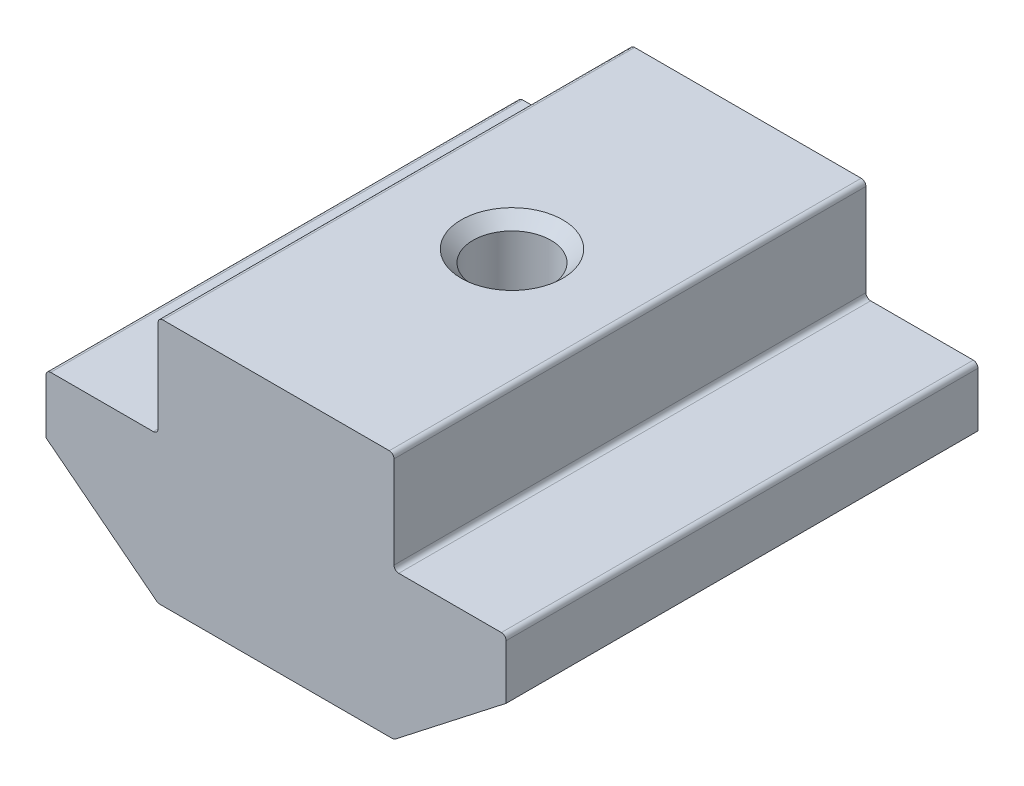
ISO-10303-21;
HEADER;
FILE_DESCRIPTION(('STEP AP214'),'2;1');
FILE_NAME('part.step','',(''),(''),'','','');
FILE_SCHEMA(('AUTOMOTIVE_DESIGN { 1 0 10303 214 1 1 1 1 }'));
ENDSEC;
DATA;
#1=APPLICATION_CONTEXT('core data for automotive mechanical design processes');
#2=APPLICATION_PROTOCOL_DEFINITION('international standard','automotive_design',2000,#1);
#3=PRODUCT_CONTEXT('',#1,'mechanical');
#4=PRODUCT('Part','Part','',(#3));
#5=PRODUCT_RELATED_PRODUCT_CATEGORY('part','',(#4));
#6=PRODUCT_DEFINITION_FORMATION('','',#4);
#7=PRODUCT_DEFINITION_CONTEXT('part definition',#1,'design');
#8=PRODUCT_DEFINITION('design','',#6,#7);
#9=PRODUCT_DEFINITION_SHAPE('','',#8);
#10=(LENGTH_UNIT() NAMED_UNIT(*) SI_UNIT(.MILLI.,.METRE.));
#11=(NAMED_UNIT(*) PLANE_ANGLE_UNIT() SI_UNIT($,.RADIAN.));
#12=(NAMED_UNIT(*) SI_UNIT($,.STERADIAN.) SOLID_ANGLE_UNIT());
#13=UNCERTAINTY_MEASURE_WITH_UNIT(LENGTH_MEASURE(1.E-05),#10,'distance_accuracy_value','');
#14=(GEOMETRIC_REPRESENTATION_CONTEXT(3) GLOBAL_UNCERTAINTY_ASSIGNED_CONTEXT((#13)) GLOBAL_UNIT_ASSIGNED_CONTEXT((#10,
#11,#12)) REPRESENTATION_CONTEXT('',''));
#15=CARTESIAN_POINT('',(0.,0.,0.));
#16=DIRECTION('',(0.,0.,1.));
#17=DIRECTION('',(1.,0.,0.));
#18=AXIS2_PLACEMENT_3D('',#15,#16,#17);
#19=CARTESIAN_POINT('',(-5.,0.,10.));
#20=DIRECTION('',(1.,0.,0.));
#21=DIRECTION('',(0.,1.,0.));
#22=AXIS2_PLACEMENT_3D('',#19,#20,#21);
#23=PLANE('',#22);
#24=DIRECTION('',(0.,-1.,0.));
#25=VECTOR('',#24,1.);
#26=CARTESIAN_POINT('',(-5.,0.,10.));
#27=LINE('',#26,#25);
#28=CARTESIAN_POINT('',(-5.,-0.200000000000003,10.));
#29=VERTEX_POINT('',#28);
#30=CARTESIAN_POINT('',(-5.,-4.1,10.));
#31=VERTEX_POINT('',#30);
#32=EDGE_CURVE('E234',#29,#31,#27,.T.);
#33=ORIENTED_EDGE('',*,*,#32,.F.);
#34=DIRECTION('',(0.,0.,-1.));
#35=VECTOR('',#34,1.);
#36=CARTESIAN_POINT('',(-5.,-0.200000000000003,10.));
#37=LINE('',#36,#35);
#38=CARTESIAN_POINT('',(-5.,-0.200000000000003,-10.));
#39=VERTEX_POINT('',#38);
#40=EDGE_CURVE('E285',#29,#39,#37,.T.);
#41=ORIENTED_EDGE('',*,*,#40,.T.);
#42=DIRECTION('',(0.,-1.,0.));
#43=VECTOR('',#42,1.);
#44=CARTESIAN_POINT('',(-5.,0.,-10.));
#45=LINE('',#44,#43);
#46=CARTESIAN_POINT('',(-5.,-4.1,-10.));
#47=VERTEX_POINT('',#46);
#48=EDGE_CURVE('E208',#39,#47,#45,.T.);
#49=ORIENTED_EDGE('',*,*,#48,.T.);
#50=DIRECTION('',(0.,0.,-1.));
#51=VECTOR('',#50,1.);
#52=CARTESIAN_POINT('',(-5.,-4.1,10.));
#53=LINE('',#52,#51);
#54=EDGE_CURVE('E283',#47,#31,#53,.F.);
#55=ORIENTED_EDGE('',*,*,#54,.T.);
#56=EDGE_LOOP('',(#33,#41,#49,#55));
#57=FACE_BOUND('',#56,.T.);
#58=ADVANCED_FACE('F37',(#57),#23,.F.);
#59=CARTESIAN_POINT('',(-5.,-4.3,10.));
#60=DIRECTION('',(0.,-1.,0.));
#61=DIRECTION('',(1.,0.,0.));
#62=AXIS2_PLACEMENT_3D('',#59,#60,#61);
#63=PLANE('',#62);
#64=DIRECTION('',(-1.,0.,0.));
#65=VECTOR('',#64,1.);
#66=CARTESIAN_POINT('',(-5.,-4.3,-10.));
#67=LINE('',#66,#65);
#68=CARTESIAN_POINT('',(-5.2,-4.3,-10.));
#69=VERTEX_POINT('',#68);
#70=CARTESIAN_POINT('',(-9.55,-4.3,-10.));
#71=VERTEX_POINT('',#70);
#72=EDGE_CURVE('E211',#69,#71,#67,.T.);
#73=ORIENTED_EDGE('',*,*,#72,.T.);
#74=DIRECTION('',(0.,0.,-1.));
#75=VECTOR('',#74,1.);
#76=CARTESIAN_POINT('',(-9.55,-4.3,10.));
#77=LINE('',#76,#75);
#78=CARTESIAN_POINT('',(-9.55,-4.3,10.));
#79=VERTEX_POINT('',#78);
#80=EDGE_CURVE('E293',#71,#79,#77,.F.);
#81=ORIENTED_EDGE('',*,*,#80,.T.);
#82=DIRECTION('',(-1.,0.,0.));
#83=VECTOR('',#82,1.);
#84=CARTESIAN_POINT('',(-5.,-4.3,10.));
#85=LINE('',#84,#83);
#86=CARTESIAN_POINT('',(-5.2,-4.3,10.));
#87=VERTEX_POINT('',#86);
#88=EDGE_CURVE('E175',#87,#79,#85,.T.);
#89=ORIENTED_EDGE('',*,*,#88,.F.);
#90=DIRECTION('',(0.,0.,-1.));
#91=VECTOR('',#90,1.);
#92=CARTESIAN_POINT('',(-5.2,-4.3,-10.));
#93=LINE('',#92,#91);
#94=EDGE_CURVE('E290',#87,#69,#93,.T.);
#95=ORIENTED_EDGE('',*,*,#94,.T.);
#96=EDGE_LOOP('',(#73,#81,#89,#95));
#97=FACE_BOUND('',#96,.T.);
#98=ADVANCED_FACE('F313',(#97),#63,.F.);
#99=CARTESIAN_POINT('',(-9.75,-4.3,10.));
#100=DIRECTION('',(1.,0.,0.));
#101=DIRECTION('',(0.,0.,-1.));
#102=AXIS2_PLACEMENT_3D('',#99,#100,#101);
#103=PLANE('',#102);
#104=DIRECTION('',(0.,-1.,0.));
#105=VECTOR('',#104,1.);
#106=CARTESIAN_POINT('',(-9.75,-4.3,10.));
#107=LINE('',#106,#105);
#108=CARTESIAN_POINT('',(-9.75,-4.5,10.));
#109=VERTEX_POINT('',#108);
#110=CARTESIAN_POINT('',(-9.75,-6.8,10.));
#111=VERTEX_POINT('',#110);
#112=EDGE_CURVE('E162',#109,#111,#107,.T.);
#113=ORIENTED_EDGE('',*,*,#112,.F.);
#114=DIRECTION('',(0.,0.,-1.));
#115=VECTOR('',#114,1.);
#116=CARTESIAN_POINT('',(-9.75,-4.5,10.));
#117=LINE('',#116,#115);
#118=CARTESIAN_POINT('',(-9.75,-4.5,-10.));
#119=VERTEX_POINT('',#118);
#120=EDGE_CURVE('E288',#109,#119,#117,.T.);
#121=ORIENTED_EDGE('',*,*,#120,.T.);
#122=DIRECTION('',(0.,-1.,0.));
#123=VECTOR('',#122,1.);
#124=CARTESIAN_POINT('',(-9.75,-4.3,-10.));
#125=LINE('',#124,#123);
#126=CARTESIAN_POINT('',(-9.75,-6.8,-10.));
#127=VERTEX_POINT('',#126);
#128=EDGE_CURVE('E181',#119,#127,#125,.T.);
#129=ORIENTED_EDGE('',*,*,#128,.T.);
#130=DIRECTION('',(0.,0.,-1.));
#131=VECTOR('',#130,1.);
#132=CARTESIAN_POINT('',(-9.75,-6.8,10.));
#133=LINE('',#132,#131);
#134=EDGE_CURVE('E178',#111,#127,#133,.T.);
#135=ORIENTED_EDGE('',*,*,#134,.F.);
#136=EDGE_LOOP('',(#113,#121,#129,#135));
#137=FACE_BOUND('',#136,.T.);
#138=ADVANCED_FACE('F179',(#137),#103,.F.);
#139=CARTESIAN_POINT('',(-9.75,-6.8,10.));
#140=DIRECTION('',(0.614515361098146,0.788904855463836,0.));
#141=DIRECTION('',(-0.788904855463836,0.614515361098146,0.));
#142=AXIS2_PLACEMENT_3D('',#139,#140,#141);
#143=PLANE('',#142);
#144=DIRECTION('',(0.788904855463836,-0.614515361098146,0.));
#145=VECTOR('',#144,1.);
#146=CARTESIAN_POINT('',(-9.75,-6.8,-10.));
#147=LINE('',#146,#145);
#148=CARTESIAN_POINT('',(-5.05420010467821,-10.4577809710928,-10.));
#149=VERTEX_POINT('',#148);
#150=EDGE_CURVE('E216',#127,#149,#147,.T.);
#151=ORIENTED_EDGE('',*,*,#150,.T.);
#152=DIRECTION('',(0.,0.,-1.));
#153=VECTOR('',#152,1.);
#154=CARTESIAN_POINT('',(-5.05420010467821,-10.4577809710928,10.));
#155=LINE('',#154,#153);
#156=CARTESIAN_POINT('',(-5.05420010467821,-10.4577809710928,10.));
#157=VERTEX_POINT('',#156);
#158=EDGE_CURVE('E190',#149,#157,#155,.F.);
#159=ORIENTED_EDGE('',*,*,#158,.T.);
#160=DIRECTION('',(0.788904855463836,-0.614515361098146,0.));
#161=VECTOR('',#160,1.);
#162=CARTESIAN_POINT('',(-9.75,-6.8,10.));
#163=LINE('',#162,#161);
#164=EDGE_CURVE('E167',#111,#157,#163,.T.);
#165=ORIENTED_EDGE('',*,*,#164,.F.);
#166=ORIENTED_EDGE('',*,*,#134,.T.);
#167=EDGE_LOOP('',(#151,#159,#165,#166));
#168=FACE_BOUND('',#167,.T.);
#169=ADVANCED_FACE('F188',(#168),#143,.F.);
#170=CARTESIAN_POINT('',(-5.,-10.5,10.));
#171=DIRECTION('',(0.,1.,0.));
#172=DIRECTION('',(0.,0.,1.));
#173=AXIS2_PLACEMENT_3D('',#170,#171,#172);
#174=PLANE('',#173);
#175=CARTESIAN_POINT('',(0.,-10.5,0.));
#176=DIRECTION('',(0.,1.,0.));
#177=DIRECTION('',(0.,0.,1.));
#178=AXIS2_PLACEMENT_3D('',#175,#176,#177);
#179=CIRCLE('',#178,2.15);
#180=CARTESIAN_POINT('',(0.,-10.5,2.15));
#181=VERTEX_POINT('',#180);
#182=EDGE_CURVE('E325',#181,#181,#179,.T.);
#183=ORIENTED_EDGE('',*,*,#182,.T.);
#184=EDGE_LOOP('',(#183));
#185=FACE_BOUND('',#184,.T.);
#186=DIRECTION('',(1.,0.,0.));
#187=VECTOR('',#186,1.);
#188=CARTESIAN_POINT('',(-5.,-10.5,-10.));
#189=LINE('',#188,#187);
#190=CARTESIAN_POINT('',(-4.93129703245858,-10.5,-10.));
#191=VERTEX_POINT('',#190);
#192=CARTESIAN_POINT('',(4.93129703245858,-10.5,-10.));
#193=VERTEX_POINT('',#192);
#194=EDGE_CURVE('E218',#191,#193,#189,.T.);
#195=ORIENTED_EDGE('',*,*,#194,.T.);
#196=DIRECTION('',(0.,0.,-1.));
#197=VECTOR('',#196,1.);
#198=CARTESIAN_POINT('',(4.93129703245858,-10.5,10.));
#199=LINE('',#198,#197);
#200=CARTESIAN_POINT('',(4.93129703245858,-10.5,10.));
#201=VERTEX_POINT('',#200);
#202=EDGE_CURVE('E254',#193,#201,#199,.F.);
#203=ORIENTED_EDGE('',*,*,#202,.T.);
#204=DIRECTION('',(1.,0.,0.));
#205=VECTOR('',#204,1.);
#206=CARTESIAN_POINT('',(-5.,-10.5,10.));
#207=LINE('',#206,#205);
#208=CARTESIAN_POINT('',(-4.93129703245858,-10.5,10.));
#209=VERTEX_POINT('',#208);
#210=EDGE_CURVE('E191',#209,#201,#207,.T.);
#211=ORIENTED_EDGE('',*,*,#210,.F.);
#212=DIRECTION('',(0.,0.,-1.));
#213=VECTOR('',#212,1.);
#214=CARTESIAN_POINT('',(-4.93129703245858,-10.5,10.));
#215=LINE('',#214,#213);
#216=EDGE_CURVE('E251',#209,#191,#215,.T.);
#217=ORIENTED_EDGE('',*,*,#216,.T.);
#218=EDGE_LOOP('',(#195,#203,#211,#217));
#219=FACE_BOUND('',#218,.T.);
#220=ADVANCED_FACE('F329',(#185,#219),#174,.F.);
#221=CARTESIAN_POINT('',(9.75,-6.8,10.));
#222=DIRECTION('',(-0.614515361098146,0.788904855463836,0.));
#223=DIRECTION('',(-0.788904855463836,-0.614515361098146,0.));
#224=AXIS2_PLACEMENT_3D('',#221,#222,#223);
#225=PLANE('',#224);
#226=DIRECTION('',(0.788904855463836,0.614515361098146,0.));
#227=VECTOR('',#226,1.);
#228=CARTESIAN_POINT('',(9.75,-6.8,10.));
#229=LINE('',#228,#227);
#230=CARTESIAN_POINT('',(5.05420010467821,-10.4577809710928,10.));
#231=VERTEX_POINT('',#230);
#232=CARTESIAN_POINT('',(9.75,-6.8,10.));
#233=VERTEX_POINT('',#232);
#234=EDGE_CURVE('E193',#231,#233,#229,.T.);
#235=ORIENTED_EDGE('',*,*,#234,.F.);
#236=DIRECTION('',(0.,0.,-1.));
#237=VECTOR('',#236,1.);
#238=CARTESIAN_POINT('',(5.05420010467821,-10.4577809710928,10.));
#239=LINE('',#238,#237);
#240=CARTESIAN_POINT('',(5.05420010467821,-10.4577809710928,-10.));
#241=VERTEX_POINT('',#240);
#242=EDGE_CURVE('E185',#231,#241,#239,.T.);
#243=ORIENTED_EDGE('',*,*,#242,.T.);
#244=DIRECTION('',(0.788904855463836,0.614515361098146,0.));
#245=VECTOR('',#244,1.);
#246=CARTESIAN_POINT('',(9.75,-6.8,-10.));
#247=LINE('',#246,#245);
#248=CARTESIAN_POINT('',(9.75,-6.8,-10.));
#249=VERTEX_POINT('',#248);
#250=EDGE_CURVE('E221',#241,#249,#247,.T.);
#251=ORIENTED_EDGE('',*,*,#250,.T.);
#252=DIRECTION('',(0.,0.,-1.));
#253=VECTOR('',#252,1.);
#254=CARTESIAN_POINT('',(9.75,-6.8,10.));
#255=LINE('',#254,#253);
#256=EDGE_CURVE('E186',#233,#249,#255,.T.);
#257=ORIENTED_EDGE('',*,*,#256,.F.);
#258=EDGE_LOOP('',(#235,#243,#251,#257));
#259=FACE_BOUND('',#258,.T.);
#260=ADVANCED_FACE('F385',(#259),#225,.F.);
#261=CARTESIAN_POINT('',(9.75,-4.3,10.));
#262=DIRECTION('',(-1.,0.,0.));
#263=DIRECTION('',(0.,0.,1.));
#264=AXIS2_PLACEMENT_3D('',#261,#262,#263);
#265=PLANE('',#264);
#266=DIRECTION('',(0.,1.,0.));
#267=VECTOR('',#266,1.);
#268=CARTESIAN_POINT('',(9.75,-4.3,-10.));
#269=LINE('',#268,#267);
#270=CARTESIAN_POINT('',(9.75,-4.5,-10.));
#271=VERTEX_POINT('',#270);
#272=EDGE_CURVE('E223',#249,#271,#269,.T.);
#273=ORIENTED_EDGE('',*,*,#272,.T.);
#274=DIRECTION('',(0.,0.,-1.));
#275=VECTOR('',#274,1.);
#276=CARTESIAN_POINT('',(9.75,-4.5,10.));
#277=LINE('',#276,#275);
#278=CARTESIAN_POINT('',(9.75,-4.5,10.));
#279=VERTEX_POINT('',#278);
#280=EDGE_CURVE('E272',#271,#279,#277,.F.);
#281=ORIENTED_EDGE('',*,*,#280,.T.);
#282=DIRECTION('',(0.,1.,0.));
#283=VECTOR('',#282,1.);
#284=CARTESIAN_POINT('',(9.75,-4.3,10.));
#285=LINE('',#284,#283);
#286=EDGE_CURVE('E198',#233,#279,#285,.T.);
#287=ORIENTED_EDGE('',*,*,#286,.F.);
#288=ORIENTED_EDGE('',*,*,#256,.T.);
#289=EDGE_LOOP('',(#273,#281,#287,#288));
#290=FACE_BOUND('',#289,.T.);
#291=ADVANCED_FACE('F380',(#290),#265,.F.);
#292=CARTESIAN_POINT('',(5.,-4.3,10.));
#293=DIRECTION('',(0.,-1.,0.));
#294=DIRECTION('',(1.,0.,0.));
#295=AXIS2_PLACEMENT_3D('',#292,#293,#294);
#296=PLANE('',#295);
#297=DIRECTION('',(-1.,0.,0.));
#298=VECTOR('',#297,1.);
#299=CARTESIAN_POINT('',(5.,-4.3,10.));
#300=LINE('',#299,#298);
#301=CARTESIAN_POINT('',(9.55,-4.3,10.));
#302=VERTEX_POINT('',#301);
#303=CARTESIAN_POINT('',(5.2,-4.3,10.));
#304=VERTEX_POINT('',#303);
#305=EDGE_CURVE('E201',#302,#304,#300,.T.);
#306=ORIENTED_EDGE('',*,*,#305,.F.);
#307=DIRECTION('',(0.,0.,-1.));
#308=VECTOR('',#307,1.);
#309=CARTESIAN_POINT('',(9.55,-4.3,10.));
#310=LINE('',#309,#308);
#311=CARTESIAN_POINT('',(9.55,-4.3,-10.));
#312=VERTEX_POINT('',#311);
#313=EDGE_CURVE('E269',#302,#312,#310,.T.);
#314=ORIENTED_EDGE('',*,*,#313,.T.);
#315=DIRECTION('',(-1.,0.,0.));
#316=VECTOR('',#315,1.);
#317=CARTESIAN_POINT('',(5.,-4.3,-10.));
#318=LINE('',#317,#316);
#319=CARTESIAN_POINT('',(5.2,-4.3,-10.));
#320=VERTEX_POINT('',#319);
#321=EDGE_CURVE('E226',#312,#320,#318,.T.);
#322=ORIENTED_EDGE('',*,*,#321,.T.);
#323=DIRECTION('',(0.,0.,-1.));
#324=VECTOR('',#323,1.);
#325=CARTESIAN_POINT('',(5.2,-4.3,10.));
#326=LINE('',#325,#324);
#327=EDGE_CURVE('E267',#320,#304,#326,.F.);
#328=ORIENTED_EDGE('',*,*,#327,.T.);
#329=EDGE_LOOP('',(#306,#314,#322,#328));
#330=FACE_BOUND('',#329,.T.);
#331=ADVANCED_FACE('F372',(#330),#296,.F.);
#332=CARTESIAN_POINT('',(5.,0.,10.));
#333=DIRECTION('',(-1.,0.,0.));
#334=DIRECTION('',(0.,-1.,0.));
#335=AXIS2_PLACEMENT_3D('',#332,#333,#334);
#336=PLANE('',#335);
#337=DIRECTION('',(0.,1.,0.));
#338=VECTOR('',#337,1.);
#339=CARTESIAN_POINT('',(5.,0.,10.));
#340=LINE('',#339,#338);
#341=CARTESIAN_POINT('',(5.,-4.1,10.));
#342=VERTEX_POINT('',#341);
#343=CARTESIAN_POINT('',(5.,-0.199999999999997,10.));
#344=VERTEX_POINT('',#343);
#345=EDGE_CURVE('E204',#342,#344,#340,.T.);
#346=ORIENTED_EDGE('',*,*,#345,.F.);
#347=DIRECTION('',(0.,0.,-1.));
#348=VECTOR('',#347,1.);
#349=CARTESIAN_POINT('',(5.,-4.1,-10.));
#350=LINE('',#349,#348);
#351=CARTESIAN_POINT('',(5.,-4.1,-10.));
#352=VERTEX_POINT('',#351);
#353=EDGE_CURVE('E276',#342,#352,#350,.T.);
#354=ORIENTED_EDGE('',*,*,#353,.T.);
#355=DIRECTION('',(0.,1.,0.));
#356=VECTOR('',#355,1.);
#357=CARTESIAN_POINT('',(5.,0.,-10.));
#358=LINE('',#357,#356);
#359=CARTESIAN_POINT('',(5.,-0.199999999999997,-10.));
#360=VERTEX_POINT('',#359);
#361=EDGE_CURVE('E229',#352,#360,#358,.T.);
#362=ORIENTED_EDGE('',*,*,#361,.T.);
#363=DIRECTION('',(0.,0.,-1.));
#364=VECTOR('',#363,1.);
#365=CARTESIAN_POINT('',(5.,-0.199999999999997,10.));
#366=LINE('',#365,#364);
#367=EDGE_CURVE('E274',#360,#344,#366,.F.);
#368=ORIENTED_EDGE('',*,*,#367,.T.);
#369=EDGE_LOOP('',(#346,#354,#362,#368));
#370=FACE_BOUND('',#369,.T.);
#371=ADVANCED_FACE('F353',(#370),#336,.F.);
#372=CARTESIAN_POINT('',(5.,0.,10.));
#373=DIRECTION('',(0.,-1.,0.));
#374=DIRECTION('',(1.,0.,0.));
#375=AXIS2_PLACEMENT_3D('',#372,#373,#374);
#376=PLANE('',#375);
#377=CARTESIAN_POINT('',(0.,0.,0.));
#378=DIRECTION('',(0.,1.,0.));
#379=DIRECTION('',(0.,0.,1.));
#380=AXIS2_PLACEMENT_3D('',#377,#378,#379);
#381=CIRCLE('',#380,2.15);
#382=CARTESIAN_POINT('',(0.,0.,2.15));
#383=VERTEX_POINT('',#382);
#384=EDGE_CURVE('E322',#383,#383,#381,.T.);
#385=ORIENTED_EDGE('',*,*,#384,.F.);
#386=EDGE_LOOP('',(#385));
#387=FACE_BOUND('',#386,.T.);
#388=DIRECTION('',(-1.,0.,0.));
#389=VECTOR('',#388,1.);
#390=CARTESIAN_POINT('',(5.,0.,10.));
#391=LINE('',#390,#389);
#392=CARTESIAN_POINT('',(4.8,0.,10.));
#393=VERTEX_POINT('',#392);
#394=CARTESIAN_POINT('',(-4.8,0.,10.));
#395=VERTEX_POINT('',#394);
#396=EDGE_CURVE('E206',#393,#395,#391,.T.);
#397=ORIENTED_EDGE('',*,*,#396,.F.);
#398=DIRECTION('',(0.,0.,-1.));
#399=VECTOR('',#398,1.);
#400=CARTESIAN_POINT('',(4.8,0.,10.));
#401=LINE('',#400,#399);
#402=CARTESIAN_POINT('',(4.8,0.,-10.));
#403=VERTEX_POINT('',#402);
#404=EDGE_CURVE('E280',#393,#403,#401,.T.);
#405=ORIENTED_EDGE('',*,*,#404,.T.);
#406=DIRECTION('',(-1.,0.,0.));
#407=VECTOR('',#406,1.);
#408=CARTESIAN_POINT('',(5.,0.,-10.));
#409=LINE('',#408,#407);
#410=CARTESIAN_POINT('',(-4.8,0.,-10.));
#411=VERTEX_POINT('',#410);
#412=EDGE_CURVE('E232',#403,#411,#409,.T.);
#413=ORIENTED_EDGE('',*,*,#412,.T.);
#414=DIRECTION('',(0.,0.,-1.));
#415=VECTOR('',#414,1.);
#416=CARTESIAN_POINT('',(-4.8,0.,10.));
#417=LINE('',#416,#415);
#418=EDGE_CURVE('E52',#411,#395,#417,.F.);
#419=ORIENTED_EDGE('',*,*,#418,.T.);
#420=EDGE_LOOP('',(#397,#405,#413,#419));
#421=FACE_BOUND('',#420,.T.);
#422=ADVANCED_FACE('F351',(#387,#421),#376,.F.);
#423=CARTESIAN_POINT('',(0.,0.,10.));
#424=DIRECTION('',(0.,0.,-1.));
#425=DIRECTION('',(-1.,0.,0.));
#426=AXIS2_PLACEMENT_3D('',#423,#424,#425);
#427=PLANE('',#426);
#428=ORIENTED_EDGE('',*,*,#210,.T.);
#429=CARTESIAN_POINT('',(4.93129703245858,-10.3,10.));
#430=DIRECTION('',(0.,0.,-1.));
#431=DIRECTION('',(-1.,0.,0.));
#432=AXIS2_PLACEMENT_3D('',#429,#430,#431);
#433=CIRCLE('',#432,0.2);
#434=EDGE_CURVE('E264',#201,#231,#433,.F.);
#435=ORIENTED_EDGE('',*,*,#434,.T.);
#436=ORIENTED_EDGE('',*,*,#234,.T.);
#437=ORIENTED_EDGE('',*,*,#286,.T.);
#438=CARTESIAN_POINT('',(9.55,-4.5,10.));
#439=DIRECTION('',(0.,0.,-1.));
#440=DIRECTION('',(-1.,0.,0.));
#441=AXIS2_PLACEMENT_3D('',#438,#439,#440);
#442=CIRCLE('',#441,0.2);
#443=EDGE_CURVE('E260',#279,#302,#442,.F.);
#444=ORIENTED_EDGE('',*,*,#443,.T.);
#445=ORIENTED_EDGE('',*,*,#305,.T.);
#446=CARTESIAN_POINT('',(5.2,-4.1,10.));
#447=DIRECTION('',(0.,0.,-1.));
#448=DIRECTION('',(-1.,0.,0.));
#449=AXIS2_PLACEMENT_3D('',#446,#447,#448);
#450=CIRCLE('',#449,0.2);
#451=EDGE_CURVE('E297',#304,#342,#450,.T.);
#452=ORIENTED_EDGE('',*,*,#451,.T.);
#453=ORIENTED_EDGE('',*,*,#345,.T.);
#454=CARTESIAN_POINT('',(4.8,-0.199999999999998,10.));
#455=DIRECTION('',(0.,0.,-1.));
#456=DIRECTION('',(-1.,0.,0.));
#457=AXIS2_PLACEMENT_3D('',#454,#455,#456);
#458=CIRCLE('',#457,0.2);
#459=EDGE_CURVE('E59',#344,#393,#458,.F.);
#460=ORIENTED_EDGE('',*,*,#459,.T.);
#461=ORIENTED_EDGE('',*,*,#396,.T.);
#462=CARTESIAN_POINT('',(-4.8,-0.200000000000003,10.));
#463=DIRECTION('',(0.,0.,-1.));
#464=DIRECTION('',(-1.,0.,0.));
#465=AXIS2_PLACEMENT_3D('',#462,#463,#464);
#466=CIRCLE('',#465,0.2);
#467=EDGE_CURVE('E257',#395,#29,#466,.F.);
#468=ORIENTED_EDGE('',*,*,#467,.T.);
#469=ORIENTED_EDGE('',*,*,#32,.T.);
#470=CARTESIAN_POINT('',(-5.2,-4.1,10.));
#471=DIRECTION('',(0.,0.,-1.));
#472=DIRECTION('',(-1.,0.,0.));
#473=AXIS2_PLACEMENT_3D('',#470,#471,#472);
#474=CIRCLE('',#473,0.2);
#475=EDGE_CURVE('E11',#31,#87,#474,.T.);
#476=ORIENTED_EDGE('',*,*,#475,.T.);
#477=ORIENTED_EDGE('',*,*,#88,.T.);
#478=CARTESIAN_POINT('',(-9.55,-4.5,10.));
#479=DIRECTION('',(0.,0.,-1.));
#480=DIRECTION('',(-1.,0.,0.));
#481=AXIS2_PLACEMENT_3D('',#478,#479,#480);
#482=CIRCLE('',#481,0.2);
#483=EDGE_CURVE('E171',#79,#109,#482,.F.);
#484=ORIENTED_EDGE('',*,*,#483,.T.);
#485=ORIENTED_EDGE('',*,*,#112,.T.);
#486=ORIENTED_EDGE('',*,*,#164,.T.);
#487=CARTESIAN_POINT('',(-4.93129703245858,-10.3,10.));
#488=DIRECTION('',(0.,0.,-1.));
#489=DIRECTION('',(-1.,0.,0.));
#490=AXIS2_PLACEMENT_3D('',#487,#488,#489);
#491=CIRCLE('',#490,0.2);
#492=EDGE_CURVE('E262',#157,#209,#491,.F.);
#493=ORIENTED_EDGE('',*,*,#492,.T.);
#494=EDGE_LOOP('',(#428,#435,#436,#437,#444,#445,#452,#453,#460,#461,#468,#469,#476,#477,#484,
#485,#486,#493));
#495=FACE_BOUND('',#494,.T.);
#496=ADVANCED_FACE('F165',(#495),#427,.F.);
#497=CARTESIAN_POINT('',(0.,0.,-10.));
#498=DIRECTION('',(0.,0.,-1.));
#499=DIRECTION('',(-1.,0.,0.));
#500=AXIS2_PLACEMENT_3D('',#497,#498,#499);
#501=PLANE('',#500);
#502=ORIENTED_EDGE('',*,*,#250,.F.);
#503=CARTESIAN_POINT('',(4.93129703245858,-10.3,-10.));
#504=DIRECTION('',(0.,0.,-1.));
#505=DIRECTION('',(-1.,0.,0.));
#506=AXIS2_PLACEMENT_3D('',#503,#504,#505);
#507=CIRCLE('',#506,0.2);
#508=EDGE_CURVE('E249',#241,#193,#507,.T.);
#509=ORIENTED_EDGE('',*,*,#508,.T.);
#510=ORIENTED_EDGE('',*,*,#194,.F.);
#511=CARTESIAN_POINT('',(-4.93129703245858,-10.3,-10.));
#512=DIRECTION('',(0.,0.,-1.));
#513=DIRECTION('',(-1.,0.,0.));
#514=AXIS2_PLACEMENT_3D('',#511,#512,#513);
#515=CIRCLE('',#514,0.2);
#516=EDGE_CURVE('E247',#191,#149,#515,.T.);
#517=ORIENTED_EDGE('',*,*,#516,.T.);
#518=ORIENTED_EDGE('',*,*,#150,.F.);
#519=ORIENTED_EDGE('',*,*,#128,.F.);
#520=CARTESIAN_POINT('',(-9.55,-4.5,-10.));
#521=DIRECTION('',(0.,0.,-1.));
#522=DIRECTION('',(-1.,0.,0.));
#523=AXIS2_PLACEMENT_3D('',#520,#521,#522);
#524=CIRCLE('',#523,0.2);
#525=EDGE_CURVE('E239',#119,#71,#524,.T.);
#526=ORIENTED_EDGE('',*,*,#525,.T.);
#527=ORIENTED_EDGE('',*,*,#72,.F.);
#528=CARTESIAN_POINT('',(-5.2,-4.1,-10.));
#529=DIRECTION('',(0.,0.,-1.));
#530=DIRECTION('',(-1.,0.,0.));
#531=AXIS2_PLACEMENT_3D('',#528,#529,#530);
#532=CIRCLE('',#531,0.2);
#533=EDGE_CURVE('E45',#69,#47,#532,.F.);
#534=ORIENTED_EDGE('',*,*,#533,.T.);
#535=ORIENTED_EDGE('',*,*,#48,.F.);
#536=CARTESIAN_POINT('',(-4.8,-0.200000000000003,-10.));
#537=DIRECTION('',(0.,0.,-1.));
#538=DIRECTION('',(-1.,0.,0.));
#539=AXIS2_PLACEMENT_3D('',#536,#537,#538);
#540=CIRCLE('',#539,0.2);
#541=EDGE_CURVE('E241',#39,#411,#540,.T.);
#542=ORIENTED_EDGE('',*,*,#541,.T.);
#543=ORIENTED_EDGE('',*,*,#412,.F.);
#544=CARTESIAN_POINT('',(4.8,-0.199999999999998,-10.));
#545=DIRECTION('',(0.,0.,-1.));
#546=DIRECTION('',(-1.,0.,0.));
#547=AXIS2_PLACEMENT_3D('',#544,#545,#546);
#548=CIRCLE('',#547,0.2);
#549=EDGE_CURVE('E243',#403,#360,#548,.T.);
#550=ORIENTED_EDGE('',*,*,#549,.T.);
#551=ORIENTED_EDGE('',*,*,#361,.F.);
#552=CARTESIAN_POINT('',(5.2,-4.1,-10.));
#553=DIRECTION('',(0.,0.,-1.));
#554=DIRECTION('',(-1.,0.,0.));
#555=AXIS2_PLACEMENT_3D('',#552,#553,#554);
#556=CIRCLE('',#555,0.2);
#557=EDGE_CURVE('E295',#352,#320,#556,.F.);
#558=ORIENTED_EDGE('',*,*,#557,.T.);
#559=ORIENTED_EDGE('',*,*,#321,.F.);
#560=CARTESIAN_POINT('',(9.55,-4.5,-10.));
#561=DIRECTION('',(0.,0.,-1.));
#562=DIRECTION('',(-1.,0.,0.));
#563=AXIS2_PLACEMENT_3D('',#560,#561,#562);
#564=CIRCLE('',#563,0.2);
#565=EDGE_CURVE('E245',#312,#271,#564,.T.);
#566=ORIENTED_EDGE('',*,*,#565,.T.);
#567=ORIENTED_EDGE('',*,*,#272,.F.);
#568=EDGE_LOOP('',(#502,#509,#510,#517,#518,#519,#526,#527,#534,#535,#542,#543,#550,#551,#558,
#559,#566,#567));
#569=FACE_BOUND('',#568,.T.);
#570=ADVANCED_FACE('F302',(#569),#501,.T.);
#571=CARTESIAN_POINT('',(0.,-10.,0.));
#572=DIRECTION('',(0.,-1.,0.));
#573=DIRECTION('',(0.,0.,-1.));
#574=AXIS2_PLACEMENT_3D('',#571,#572,#573);
#575=CONICAL_SURFACE('',#574,1.65,0.785398163397447);
#576=ORIENTED_EDGE('',*,*,#182,.F.);
#577=EDGE_LOOP('',(#576));
#578=FACE_BOUND('',#577,.T.);
#579=CARTESIAN_POINT('',(0.,-10.,0.));
#580=DIRECTION('',(0.,1.,0.));
#581=DIRECTION('',(0.,0.,1.));
#582=AXIS2_PLACEMENT_3D('',#579,#580,#581);
#583=CIRCLE('',#582,1.65);
#584=CARTESIAN_POINT('',(0.,-10.,1.65));
#585=VERTEX_POINT('',#584);
#586=EDGE_CURVE('E212',#585,#585,#583,.T.);
#587=ORIENTED_EDGE('',*,*,#586,.T.);
#588=EDGE_LOOP('',(#587));
#589=FACE_BOUND('',#588,.T.);
#590=ADVANCED_FACE('F332',(#578,#589),#575,.F.);
#591=CARTESIAN_POINT('',(0.,0.,0.));
#592=DIRECTION('',(0.,1.,0.));
#593=DIRECTION('',(0.,0.,1.));
#594=AXIS2_PLACEMENT_3D('',#591,#592,#593);
#595=CYLINDRICAL_SURFACE('',#594,1.65);
#596=ORIENTED_EDGE('',*,*,#586,.F.);
#597=EDGE_LOOP('',(#596));
#598=FACE_BOUND('',#597,.T.);
#599=CARTESIAN_POINT('',(0.,-0.5,0.));
#600=DIRECTION('',(0.,1.,0.));
#601=DIRECTION('',(0.,0.,1.));
#602=AXIS2_PLACEMENT_3D('',#599,#600,#601);
#603=CIRCLE('',#602,1.65);
#604=CARTESIAN_POINT('',(0.,-0.5,1.65));
#605=VERTEX_POINT('',#604);
#606=EDGE_CURVE('E319',#605,#605,#603,.T.);
#607=ORIENTED_EDGE('',*,*,#606,.T.);
#608=EDGE_LOOP('',(#607));
#609=FACE_BOUND('',#608,.T.);
#610=ADVANCED_FACE('F335',(#598,#609),#595,.F.);
#611=CARTESIAN_POINT('',(0.,0.,0.));
#612=DIRECTION('',(0.,1.,0.));
#613=DIRECTION('',(0.,0.,1.));
#614=AXIS2_PLACEMENT_3D('',#611,#612,#613);
#615=CONICAL_SURFACE('',#614,2.15,0.785398163397449);
#616=ORIENTED_EDGE('',*,*,#606,.F.);
#617=EDGE_LOOP('',(#616));
#618=FACE_BOUND('',#617,.T.);
#619=ORIENTED_EDGE('',*,*,#384,.T.);
#620=EDGE_LOOP('',(#619));
#621=FACE_BOUND('',#620,.T.);
#622=ADVANCED_FACE('F341',(#618,#621),#615,.F.);
#623=CARTESIAN_POINT('',(4.93129703245858,-10.3,10.));
#624=DIRECTION('',(0.,0.,-1.));
#625=DIRECTION('',(-1.,0.,0.));
#626=AXIS2_PLACEMENT_3D('',#623,#624,#625);
#627=CYLINDRICAL_SURFACE('',#626,0.2);
#628=ORIENTED_EDGE('',*,*,#434,.F.);
#629=ORIENTED_EDGE('',*,*,#202,.F.);
#630=ORIENTED_EDGE('',*,*,#508,.F.);
#631=ORIENTED_EDGE('',*,*,#242,.F.);
#632=EDGE_LOOP('',(#628,#629,#630,#631));
#633=FACE_BOUND('',#632,.T.);
#634=ADVANCED_FACE('F347',(#633),#627,.T.);
#635=CARTESIAN_POINT('',(-4.93129703245858,-10.3,10.));
#636=DIRECTION('',(0.,0.,-1.));
#637=DIRECTION('',(-1.,0.,0.));
#638=AXIS2_PLACEMENT_3D('',#635,#636,#637);
#639=CYLINDRICAL_SURFACE('',#638,0.2);
#640=ORIENTED_EDGE('',*,*,#492,.F.);
#641=ORIENTED_EDGE('',*,*,#158,.F.);
#642=ORIENTED_EDGE('',*,*,#516,.F.);
#643=ORIENTED_EDGE('',*,*,#216,.F.);
#644=EDGE_LOOP('',(#640,#641,#642,#643));
#645=FACE_BOUND('',#644,.T.);
#646=ADVANCED_FACE('F394',(#645),#639,.T.);
#647=CARTESIAN_POINT('',(9.55,-4.5,10.));
#648=DIRECTION('',(0.,0.,-1.));
#649=DIRECTION('',(-1.,0.,0.));
#650=AXIS2_PLACEMENT_3D('',#647,#648,#649);
#651=CYLINDRICAL_SURFACE('',#650,0.2);
#652=ORIENTED_EDGE('',*,*,#443,.F.);
#653=ORIENTED_EDGE('',*,*,#280,.F.);
#654=ORIENTED_EDGE('',*,*,#565,.F.);
#655=ORIENTED_EDGE('',*,*,#313,.F.);
#656=EDGE_LOOP('',(#652,#653,#654,#655));
#657=FACE_BOUND('',#656,.T.);
#658=ADVANCED_FACE('F376',(#657),#651,.T.);
#659=CARTESIAN_POINT('',(5.2,-4.1,10.));
#660=DIRECTION('',(0.,0.,1.));
#661=DIRECTION('',(1.,0.,0.));
#662=AXIS2_PLACEMENT_3D('',#659,#660,#661);
#663=CYLINDRICAL_SURFACE('',#662,0.2);
#664=ORIENTED_EDGE('',*,*,#451,.F.);
#665=ORIENTED_EDGE('',*,*,#327,.F.);
#666=ORIENTED_EDGE('',*,*,#557,.F.);
#667=ORIENTED_EDGE('',*,*,#353,.F.);
#668=EDGE_LOOP('',(#664,#665,#666,#667));
#669=FACE_BOUND('',#668,.T.);
#670=ADVANCED_FACE('F367',(#669),#663,.F.);
#671=CARTESIAN_POINT('',(4.8,-0.199999999999998,10.));
#672=DIRECTION('',(0.,0.,-1.));
#673=DIRECTION('',(-1.,0.,0.));
#674=AXIS2_PLACEMENT_3D('',#671,#672,#673);
#675=CYLINDRICAL_SURFACE('',#674,0.2);
#676=ORIENTED_EDGE('',*,*,#459,.F.);
#677=ORIENTED_EDGE('',*,*,#367,.F.);
#678=ORIENTED_EDGE('',*,*,#549,.F.);
#679=ORIENTED_EDGE('',*,*,#404,.F.);
#680=EDGE_LOOP('',(#676,#677,#678,#679));
#681=FACE_BOUND('',#680,.T.);
#682=ADVANCED_FACE('F359',(#681),#675,.T.);
#683=CARTESIAN_POINT('',(-4.8,-0.200000000000003,10.));
#684=DIRECTION('',(0.,0.,-1.));
#685=DIRECTION('',(-1.,0.,0.));
#686=AXIS2_PLACEMENT_3D('',#683,#684,#685);
#687=CYLINDRICAL_SURFACE('',#686,0.2);
#688=ORIENTED_EDGE('',*,*,#467,.F.);
#689=ORIENTED_EDGE('',*,*,#418,.F.);
#690=ORIENTED_EDGE('',*,*,#541,.F.);
#691=ORIENTED_EDGE('',*,*,#40,.F.);
#692=EDGE_LOOP('',(#688,#689,#690,#691));
#693=FACE_BOUND('',#692,.T.);
#694=ADVANCED_FACE('F398',(#693),#687,.T.);
#695=CARTESIAN_POINT('',(-9.55,-4.5,10.));
#696=DIRECTION('',(0.,0.,-1.));
#697=DIRECTION('',(-1.,0.,0.));
#698=AXIS2_PLACEMENT_3D('',#695,#696,#697);
#699=CYLINDRICAL_SURFACE('',#698,0.2);
#700=ORIENTED_EDGE('',*,*,#483,.F.);
#701=ORIENTED_EDGE('',*,*,#80,.F.);
#702=ORIENTED_EDGE('',*,*,#525,.F.);
#703=ORIENTED_EDGE('',*,*,#120,.F.);
#704=EDGE_LOOP('',(#700,#701,#702,#703));
#705=FACE_BOUND('',#704,.T.);
#706=ADVANCED_FACE('F396',(#705),#699,.T.);
#707=CARTESIAN_POINT('',(-5.2,-4.1,10.));
#708=DIRECTION('',(0.,0.,1.));
#709=DIRECTION('',(1.,0.,0.));
#710=AXIS2_PLACEMENT_3D('',#707,#708,#709);
#711=CYLINDRICAL_SURFACE('',#710,0.2);
#712=ORIENTED_EDGE('',*,*,#475,.F.);
#713=ORIENTED_EDGE('',*,*,#54,.F.);
#714=ORIENTED_EDGE('',*,*,#533,.F.);
#715=ORIENTED_EDGE('',*,*,#94,.F.);
#716=EDGE_LOOP('',(#712,#713,#714,#715));
#717=FACE_BOUND('',#716,.T.);
#718=ADVANCED_FACE('F39',(#717),#711,.F.);
#719=CLOSED_SHELL('',(#58,#98,#138,#169,#220,#260,#291,#331,#371,#422,#496,#570,#590,#610,#622,
#634,#646,#658,#670,#682,#694,#706,#718));
#720=MANIFOLD_SOLID_BREP('B2',#719);
#721=ADVANCED_BREP_SHAPE_REPRESENTATION('',(#18,#720),#14);
#722=SHAPE_DEFINITION_REPRESENTATION(#9,#721);
ENDSEC;
END-ISO-10303-21;
